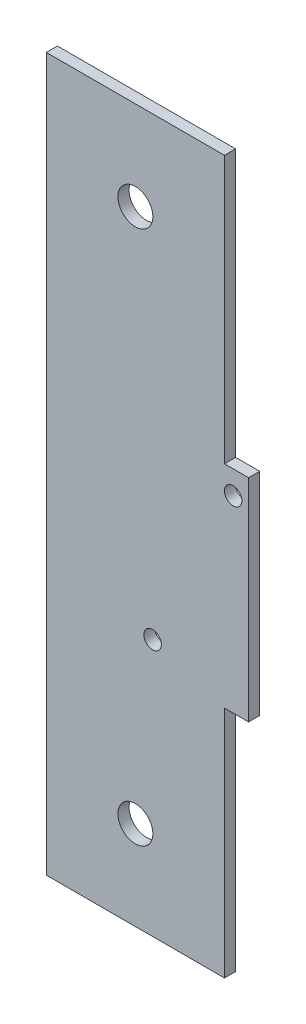
ISO-10303-21;
HEADER;
FILE_DESCRIPTION(('STEP AP214'),'2;1');
FILE_NAME('part.step','',(''),(''),'','','');
FILE_SCHEMA(('AUTOMOTIVE_DESIGN { 1 0 10303 214 1 1 1 1 }'));
ENDSEC;
DATA;
#1=APPLICATION_CONTEXT('core data for automotive mechanical design processes');
#2=APPLICATION_PROTOCOL_DEFINITION('international standard','automotive_design',2000,#1);
#3=PRODUCT_CONTEXT('',#1,'mechanical');
#4=PRODUCT('Part','Part','',(#3));
#5=PRODUCT_RELATED_PRODUCT_CATEGORY('part','',(#4));
#6=PRODUCT_DEFINITION_FORMATION('','',#4);
#7=PRODUCT_DEFINITION_CONTEXT('part definition',#1,'design');
#8=PRODUCT_DEFINITION('design','',#6,#7);
#9=PRODUCT_DEFINITION_SHAPE('','',#8);
#10=(LENGTH_UNIT() NAMED_UNIT(*) SI_UNIT(.MILLI.,.METRE.));
#11=(NAMED_UNIT(*) PLANE_ANGLE_UNIT() SI_UNIT($,.RADIAN.));
#12=(NAMED_UNIT(*) SI_UNIT($,.STERADIAN.) SOLID_ANGLE_UNIT());
#13=UNCERTAINTY_MEASURE_WITH_UNIT(LENGTH_MEASURE(1.E-05),#10,'distance_accuracy_value','');
#14=(GEOMETRIC_REPRESENTATION_CONTEXT(3) GLOBAL_UNCERTAINTY_ASSIGNED_CONTEXT((#13)) GLOBAL_UNIT_ASSIGNED_CONTEXT((#10,
#11,#12)) REPRESENTATION_CONTEXT('',''));
#15=CARTESIAN_POINT('',(0.,0.,0.));
#16=DIRECTION('',(0.,0.,1.));
#17=DIRECTION('',(1.,0.,0.));
#18=AXIS2_PLACEMENT_3D('',#15,#16,#17);
#19=CARTESIAN_POINT('',(0.,0.,1.5875));
#20=DIRECTION('',(0.,0.,1.));
#21=DIRECTION('',(1.,0.,0.));
#22=AXIS2_PLACEMENT_3D('',#19,#20,#21);
#23=PLANE('',#22);
#24=CARTESIAN_POINT('',(15.1551805399391,-115.738269015508,1.5875));
#25=DIRECTION('',(0.,0.,1.));
#26=DIRECTION('',(1.,0.,0.));
#27=AXIS2_PLACEMENT_3D('',#24,#25,#26);
#28=CIRCLE('',#27,1.24999999999989);
#29=CARTESIAN_POINT('',(16.405180539939,-115.738269015508,1.5875));
#30=VERTEX_POINT('',#29);
#31=EDGE_CURVE('E189',#30,#30,#28,.T.);
#32=ORIENTED_EDGE('',*,*,#31,.F.);
#33=EDGE_LOOP('',(#32));
#34=FACE_BOUND('',#33,.T.);
#35=CARTESIAN_POINT('',(12.7,-63.4999999999994,1.5875));
#36=DIRECTION('',(0.,0.,1.));
#37=DIRECTION('',(1.,0.,0.));
#38=AXIS2_PLACEMENT_3D('',#35,#36,#37);
#39=CIRCLE('',#38,2.4892);
#40=CARTESIAN_POINT('',(15.1892,-63.4999999999994,1.5875));
#41=VERTEX_POINT('',#40);
#42=EDGE_CURVE('E135',#41,#41,#39,.T.);
#43=ORIENTED_EDGE('',*,*,#42,.F.);
#44=EDGE_LOOP('',(#43));
#45=FACE_BOUND('',#44,.T.);
#46=DIRECTION('',(-1.,0.,0.));
#47=VECTOR('',#46,1.);
#48=CARTESIAN_POINT('',(25.3999999999991,-50.7999999999994,1.5875));
#49=LINE('',#48,#47);
#50=CARTESIAN_POINT('',(25.3999999999991,-50.7999999999994,1.5875));
#51=VERTEX_POINT('',#50);
#52=CARTESIAN_POINT('',(1.0187150381163E-12,-50.7999999999994,1.5875));
#53=VERTEX_POINT('',#52);
#54=EDGE_CURVE('E146',#51,#53,#49,.T.);
#55=ORIENTED_EDGE('',*,*,#54,.T.);
#56=DIRECTION('',(0.,-1.,0.));
#57=VECTOR('',#56,1.);
#58=CARTESIAN_POINT('',(1.0187150381163E-12,-50.7999999999994,1.5875));
#59=LINE('',#58,#57);
#60=CARTESIAN_POINT('',(1.0187150381163E-12,-152.399999999999,1.5875));
#61=VERTEX_POINT('',#60);
#62=EDGE_CURVE('E94',#53,#61,#59,.T.);
#63=ORIENTED_EDGE('',*,*,#62,.T.);
#64=DIRECTION('',(1.,0.,0.));
#65=VECTOR('',#64,1.);
#66=CARTESIAN_POINT('',(1.0187150381163E-12,-152.399999999999,1.5875));
#67=LINE('',#66,#65);
#68=CARTESIAN_POINT('',(25.3999999999991,-152.399999999999,1.5875));
#69=VERTEX_POINT('',#68);
#70=EDGE_CURVE('E161',#61,#69,#67,.T.);
#71=ORIENTED_EDGE('',*,*,#70,.T.);
#72=DIRECTION('',(0.,1.,0.));
#73=VECTOR('',#72,1.);
#74=CARTESIAN_POINT('',(25.3999999999991,-152.399999999999,1.5875));
#75=LINE('',#74,#73);
#76=CARTESIAN_POINT('',(25.3999999999991,-119.062499999999,1.5875));
#77=VERTEX_POINT('',#76);
#78=EDGE_CURVE('E174',#69,#77,#75,.T.);
#79=ORIENTED_EDGE('',*,*,#78,.T.);
#80=DIRECTION('',(1.,0.,0.));
#81=VECTOR('',#80,1.);
#82=CARTESIAN_POINT('',(25.3999999999991,-119.062499999999,1.5875));
#83=LINE('',#82,#81);
#84=CARTESIAN_POINT('',(28.8374754617669,-119.062499999999,1.5875));
#85=VERTEX_POINT('',#84);
#86=EDGE_CURVE('E113',#77,#85,#83,.T.);
#87=ORIENTED_EDGE('',*,*,#86,.T.);
#88=DIRECTION('',(0.,1.,0.));
#89=VECTOR('',#88,1.);
#90=CARTESIAN_POINT('',(28.8374754617669,-119.062499999999,1.5875));
#91=LINE('',#90,#89);
#92=CARTESIAN_POINT('',(28.8374754617669,-88.8999999999994,1.5875));
#93=VERTEX_POINT('',#92);
#94=EDGE_CURVE('E107',#85,#93,#91,.T.);
#95=ORIENTED_EDGE('',*,*,#94,.T.);
#96=DIRECTION('',(-1.,0.,0.));
#97=VECTOR('',#96,1.);
#98=CARTESIAN_POINT('',(28.8374754617669,-88.8999999999994,1.5875));
#99=LINE('',#98,#97);
#100=CARTESIAN_POINT('',(25.3999999999991,-88.8999999999994,1.5875));
#101=VERTEX_POINT('',#100);
#102=EDGE_CURVE('E111',#93,#101,#99,.T.);
#103=ORIENTED_EDGE('',*,*,#102,.T.);
#104=DIRECTION('',(0.,1.,0.));
#105=VECTOR('',#104,1.);
#106=CARTESIAN_POINT('',(25.3999999999991,-88.8999999999994,1.5875));
#107=LINE('',#106,#105);
#108=EDGE_CURVE('E51',#101,#51,#107,.T.);
#109=ORIENTED_EDGE('',*,*,#108,.T.);
#110=EDGE_LOOP('',(#55,#63,#71,#79,#87,#95,#103,#109));
#111=FACE_BOUND('',#110,.T.);
#112=CARTESIAN_POINT('',(12.7000000000001,-139.699999999999,1.5875));
#113=DIRECTION('',(0.,0.,1.));
#114=DIRECTION('',(1.,0.,0.));
#115=AXIS2_PLACEMENT_3D('',#112,#113,#114);
#116=CIRCLE('',#115,2.48920000000001);
#117=CARTESIAN_POINT('',(15.1892000000001,-139.699999999999,1.5875));
#118=VERTEX_POINT('',#117);
#119=EDGE_CURVE('E183',#118,#118,#116,.T.);
#120=ORIENTED_EDGE('',*,*,#119,.F.);
#121=EDGE_LOOP('',(#120));
#122=FACE_BOUND('',#121,.T.);
#123=CARTESIAN_POINT('',(26.6386436618155,-92.2301837100535,1.5875));
#124=DIRECTION('',(0.,0.,1.));
#125=DIRECTION('',(1.,0.,0.));
#126=AXIS2_PLACEMENT_3D('',#123,#124,#125);
#127=CIRCLE('',#126,1.24999999999989);
#128=CARTESIAN_POINT('',(27.8886436618154,-92.2301837100535,1.5875));
#129=VERTEX_POINT('',#128);
#130=EDGE_CURVE('E195',#129,#129,#127,.T.);
#131=ORIENTED_EDGE('',*,*,#130,.F.);
#132=EDGE_LOOP('',(#131));
#133=FACE_BOUND('',#132,.T.);
#134=ADVANCED_FACE('F34',(#34,#45,#111,#122,#133),#23,.T.);
#135=CARTESIAN_POINT('',(0.,0.,0.));
#136=DIRECTION('',(0.,0.,1.));
#137=DIRECTION('',(1.,0.,0.));
#138=AXIS2_PLACEMENT_3D('',#135,#136,#137);
#139=PLANE('',#138);
#140=DIRECTION('',(-1.,0.,0.));
#141=VECTOR('',#140,1.);
#142=CARTESIAN_POINT('',(25.3999999999991,-50.7999999999994,0.));
#143=LINE('',#142,#141);
#144=CARTESIAN_POINT('',(25.3999999999991,-50.7999999999994,0.));
#145=VERTEX_POINT('',#144);
#146=CARTESIAN_POINT('',(1.0187150381163E-12,-50.7999999999994,0.));
#147=VERTEX_POINT('',#146);
#148=EDGE_CURVE('E131',#145,#147,#143,.T.);
#149=ORIENTED_EDGE('',*,*,#148,.F.);
#150=DIRECTION('',(0.,1.,0.));
#151=VECTOR('',#150,1.);
#152=CARTESIAN_POINT('',(25.3999999999991,-88.8999999999994,0.));
#153=LINE('',#152,#151);
#154=CARTESIAN_POINT('',(25.3999999999991,-88.8999999999994,0.));
#155=VERTEX_POINT('',#154);
#156=EDGE_CURVE('E86',#155,#145,#153,.T.);
#157=ORIENTED_EDGE('',*,*,#156,.F.);
#158=DIRECTION('',(-1.,0.,0.));
#159=VECTOR('',#158,1.);
#160=CARTESIAN_POINT('',(28.8374754617669,-88.8999999999994,0.));
#161=LINE('',#160,#159);
#162=CARTESIAN_POINT('',(28.8374754617669,-88.8999999999994,0.));
#163=VERTEX_POINT('',#162);
#164=EDGE_CURVE('E80',#163,#155,#161,.T.);
#165=ORIENTED_EDGE('',*,*,#164,.F.);
#166=DIRECTION('',(0.,1.,0.));
#167=VECTOR('',#166,1.);
#168=CARTESIAN_POINT('',(28.8374754617669,-119.062499999999,0.));
#169=LINE('',#168,#167);
#170=CARTESIAN_POINT('',(28.8374754617669,-119.062499999999,0.));
#171=VERTEX_POINT('',#170);
#172=EDGE_CURVE('E121',#171,#163,#169,.T.);
#173=ORIENTED_EDGE('',*,*,#172,.F.);
#174=DIRECTION('',(1.,0.,0.));
#175=VECTOR('',#174,1.);
#176=CARTESIAN_POINT('',(25.3999999999991,-119.062499999999,0.));
#177=LINE('',#176,#175);
#178=CARTESIAN_POINT('',(25.3999999999991,-119.062499999999,0.));
#179=VERTEX_POINT('',#178);
#180=EDGE_CURVE('E141',#179,#171,#177,.T.);
#181=ORIENTED_EDGE('',*,*,#180,.F.);
#182=DIRECTION('',(0.,1.,0.));
#183=VECTOR('',#182,1.);
#184=CARTESIAN_POINT('',(25.3999999999991,-152.399999999999,0.));
#185=LINE('',#184,#183);
#186=CARTESIAN_POINT('',(25.3999999999991,-152.399999999999,0.));
#187=VERTEX_POINT('',#186);
#188=EDGE_CURVE('E139',#187,#179,#185,.T.);
#189=ORIENTED_EDGE('',*,*,#188,.F.);
#190=DIRECTION('',(1.,0.,0.));
#191=VECTOR('',#190,1.);
#192=CARTESIAN_POINT('',(1.0187150381163E-12,-152.399999999999,0.));
#193=LINE('',#192,#191);
#194=CARTESIAN_POINT('',(1.0187150381163E-12,-152.399999999999,0.));
#195=VERTEX_POINT('',#194);
#196=EDGE_CURVE('E137',#195,#187,#193,.T.);
#197=ORIENTED_EDGE('',*,*,#196,.F.);
#198=DIRECTION('',(0.,-1.,0.));
#199=VECTOR('',#198,1.);
#200=CARTESIAN_POINT('',(1.0187150381163E-12,-50.7999999999994,0.));
#201=LINE('',#200,#199);
#202=EDGE_CURVE('E134',#147,#195,#201,.T.);
#203=ORIENTED_EDGE('',*,*,#202,.F.);
#204=EDGE_LOOP('',(#149,#157,#165,#173,#181,#189,#197,#203));
#205=FACE_BOUND('',#204,.T.);
#206=CARTESIAN_POINT('',(12.7,-63.4999999999994,0.));
#207=DIRECTION('',(0.,0.,1.));
#208=DIRECTION('',(1.,0.,0.));
#209=AXIS2_PLACEMENT_3D('',#206,#207,#208);
#210=CIRCLE('',#209,2.4892);
#211=CARTESIAN_POINT('',(15.1892,-63.4999999999994,0.));
#212=VERTEX_POINT('',#211);
#213=EDGE_CURVE('E180',#212,#212,#210,.T.);
#214=ORIENTED_EDGE('',*,*,#213,.T.);
#215=EDGE_LOOP('',(#214));
#216=FACE_BOUND('',#215,.T.);
#217=CARTESIAN_POINT('',(12.7000000000001,-139.699999999999,0.));
#218=DIRECTION('',(0.,0.,1.));
#219=DIRECTION('',(1.,0.,0.));
#220=AXIS2_PLACEMENT_3D('',#217,#218,#219);
#221=CIRCLE('',#220,2.48920000000001);
#222=CARTESIAN_POINT('',(15.1892000000001,-139.699999999999,0.));
#223=VERTEX_POINT('',#222);
#224=EDGE_CURVE('E186',#223,#223,#221,.T.);
#225=ORIENTED_EDGE('',*,*,#224,.T.);
#226=EDGE_LOOP('',(#225));
#227=FACE_BOUND('',#226,.T.);
#228=CARTESIAN_POINT('',(15.1551805399391,-115.738269015508,0.));
#229=DIRECTION('',(0.,0.,1.));
#230=DIRECTION('',(1.,0.,0.));
#231=AXIS2_PLACEMENT_3D('',#228,#229,#230);
#232=CIRCLE('',#231,1.24999999999989);
#233=CARTESIAN_POINT('',(16.405180539939,-115.738269015508,0.));
#234=VERTEX_POINT('',#233);
#235=EDGE_CURVE('E192',#234,#234,#232,.T.);
#236=ORIENTED_EDGE('',*,*,#235,.T.);
#237=EDGE_LOOP('',(#236));
#238=FACE_BOUND('',#237,.T.);
#239=CARTESIAN_POINT('',(26.6386436618155,-92.2301837100535,0.));
#240=DIRECTION('',(0.,0.,1.));
#241=DIRECTION('',(1.,0.,0.));
#242=AXIS2_PLACEMENT_3D('',#239,#240,#241);
#243=CIRCLE('',#242,1.24999999999989);
#244=CARTESIAN_POINT('',(27.8886436618154,-92.2301837100535,0.));
#245=VERTEX_POINT('',#244);
#246=EDGE_CURVE('E198',#245,#245,#243,.T.);
#247=ORIENTED_EDGE('',*,*,#246,.T.);
#248=EDGE_LOOP('',(#247));
#249=FACE_BOUND('',#248,.T.);
#250=ADVANCED_FACE('F165',(#205,#216,#227,#238,#249),#139,.F.);
#251=CARTESIAN_POINT('',(25.3999999999991,-50.7999999999994,1.5875));
#252=DIRECTION('',(0.,-1.,0.));
#253=DIRECTION('',(0.,0.,-1.));
#254=AXIS2_PLACEMENT_3D('',#251,#252,#253);
#255=PLANE('',#254);
#256=ORIENTED_EDGE('',*,*,#148,.T.);
#257=DIRECTION('',(0.,0.,-1.));
#258=VECTOR('',#257,1.);
#259=CARTESIAN_POINT('',(1.0187150381163E-12,-50.7999999999994,1.5875));
#260=LINE('',#259,#258);
#261=EDGE_CURVE('E11',#53,#147,#260,.T.);
#262=ORIENTED_EDGE('',*,*,#261,.F.);
#263=ORIENTED_EDGE('',*,*,#54,.F.);
#264=DIRECTION('',(0.,0.,-1.));
#265=VECTOR('',#264,1.);
#266=CARTESIAN_POINT('',(25.3999999999991,-50.7999999999994,1.5875));
#267=LINE('',#266,#265);
#268=EDGE_CURVE('E127',#51,#145,#267,.T.);
#269=ORIENTED_EDGE('',*,*,#268,.T.);
#270=EDGE_LOOP('',(#256,#262,#263,#269));
#271=FACE_BOUND('',#270,.T.);
#272=ADVANCED_FACE('F36',(#271),#255,.F.);
#273=CARTESIAN_POINT('',(1.0187150381163E-12,-50.7999999999994,1.5875));
#274=DIRECTION('',(1.,0.,0.));
#275=DIRECTION('',(0.,0.,-1.));
#276=AXIS2_PLACEMENT_3D('',#273,#274,#275);
#277=PLANE('',#276);
#278=ORIENTED_EDGE('',*,*,#202,.T.);
#279=DIRECTION('',(0.,0.,-1.));
#280=VECTOR('',#279,1.);
#281=CARTESIAN_POINT('',(1.0187150381163E-12,-152.399999999999,1.5875));
#282=LINE('',#281,#280);
#283=EDGE_CURVE('E43',#61,#195,#282,.T.);
#284=ORIENTED_EDGE('',*,*,#283,.F.);
#285=ORIENTED_EDGE('',*,*,#62,.F.);
#286=ORIENTED_EDGE('',*,*,#261,.T.);
#287=EDGE_LOOP('',(#278,#284,#285,#286));
#288=FACE_BOUND('',#287,.T.);
#289=ADVANCED_FACE('F232',(#288),#277,.F.);
#290=CARTESIAN_POINT('',(1.0187150381163E-12,-152.399999999999,1.5875));
#291=DIRECTION('',(0.,1.,0.));
#292=DIRECTION('',(0.,0.,1.));
#293=AXIS2_PLACEMENT_3D('',#290,#291,#292);
#294=PLANE('',#293);
#295=ORIENTED_EDGE('',*,*,#196,.T.);
#296=DIRECTION('',(0.,0.,-1.));
#297=VECTOR('',#296,1.);
#298=CARTESIAN_POINT('',(25.3999999999991,-152.399999999999,1.5875));
#299=LINE('',#298,#297);
#300=EDGE_CURVE('E153',#69,#187,#299,.T.);
#301=ORIENTED_EDGE('',*,*,#300,.F.);
#302=ORIENTED_EDGE('',*,*,#70,.F.);
#303=ORIENTED_EDGE('',*,*,#283,.T.);
#304=EDGE_LOOP('',(#295,#301,#302,#303));
#305=FACE_BOUND('',#304,.T.);
#306=ADVANCED_FACE('F159',(#305),#294,.F.);
#307=CARTESIAN_POINT('',(25.3999999999991,-152.399999999999,1.5875));
#308=DIRECTION('',(-1.,0.,0.));
#309=DIRECTION('',(0.,0.,1.));
#310=AXIS2_PLACEMENT_3D('',#307,#308,#309);
#311=PLANE('',#310);
#312=ORIENTED_EDGE('',*,*,#188,.T.);
#313=DIRECTION('',(0.,0.,-1.));
#314=VECTOR('',#313,1.);
#315=CARTESIAN_POINT('',(25.3999999999991,-119.062499999999,1.5875));
#316=LINE('',#315,#314);
#317=EDGE_CURVE('E150',#77,#179,#316,.T.);
#318=ORIENTED_EDGE('',*,*,#317,.F.);
#319=ORIENTED_EDGE('',*,*,#78,.F.);
#320=ORIENTED_EDGE('',*,*,#300,.T.);
#321=EDGE_LOOP('',(#312,#318,#319,#320));
#322=FACE_BOUND('',#321,.T.);
#323=ADVANCED_FACE('F170',(#322),#311,.F.);
#324=CARTESIAN_POINT('',(25.3999999999991,-119.062499999999,1.5875));
#325=DIRECTION('',(0.,1.,0.));
#326=DIRECTION('',(0.,0.,1.));
#327=AXIS2_PLACEMENT_3D('',#324,#325,#326);
#328=PLANE('',#327);
#329=ORIENTED_EDGE('',*,*,#180,.T.);
#330=DIRECTION('',(0.,0.,-1.));
#331=VECTOR('',#330,1.);
#332=CARTESIAN_POINT('',(28.8374754617669,-119.062499999999,1.5875));
#333=LINE('',#332,#331);
#334=EDGE_CURVE('E122',#85,#171,#333,.T.);
#335=ORIENTED_EDGE('',*,*,#334,.F.);
#336=ORIENTED_EDGE('',*,*,#86,.F.);
#337=ORIENTED_EDGE('',*,*,#317,.T.);
#338=EDGE_LOOP('',(#329,#335,#336,#337));
#339=FACE_BOUND('',#338,.T.);
#340=ADVANCED_FACE('F173',(#339),#328,.F.);
#341=CARTESIAN_POINT('',(28.8374754617669,-119.062499999999,1.5875));
#342=DIRECTION('',(-1.,0.,0.));
#343=DIRECTION('',(0.,0.,1.));
#344=AXIS2_PLACEMENT_3D('',#341,#342,#343);
#345=PLANE('',#344);
#346=ORIENTED_EDGE('',*,*,#172,.T.);
#347=DIRECTION('',(0.,0.,-1.));
#348=VECTOR('',#347,1.);
#349=CARTESIAN_POINT('',(28.8374754617669,-88.8999999999994,1.5875));
#350=LINE('',#349,#348);
#351=EDGE_CURVE('E118',#93,#163,#350,.T.);
#352=ORIENTED_EDGE('',*,*,#351,.F.);
#353=ORIENTED_EDGE('',*,*,#94,.F.);
#354=ORIENTED_EDGE('',*,*,#334,.T.);
#355=EDGE_LOOP('',(#346,#352,#353,#354));
#356=FACE_BOUND('',#355,.T.);
#357=ADVANCED_FACE('F119',(#356),#345,.F.);
#358=CARTESIAN_POINT('',(28.8374754617669,-88.8999999999994,1.5875));
#359=DIRECTION('',(0.,-1.,0.));
#360=DIRECTION('',(0.,0.,-1.));
#361=AXIS2_PLACEMENT_3D('',#358,#359,#360);
#362=PLANE('',#361);
#363=ORIENTED_EDGE('',*,*,#164,.T.);
#364=DIRECTION('',(0.,0.,-1.));
#365=VECTOR('',#364,1.);
#366=CARTESIAN_POINT('',(25.3999999999991,-88.8999999999994,1.5875));
#367=LINE('',#366,#365);
#368=EDGE_CURVE('E123',#101,#155,#367,.T.);
#369=ORIENTED_EDGE('',*,*,#368,.F.);
#370=ORIENTED_EDGE('',*,*,#102,.F.);
#371=ORIENTED_EDGE('',*,*,#351,.T.);
#372=EDGE_LOOP('',(#363,#369,#370,#371));
#373=FACE_BOUND('',#372,.T.);
#374=ADVANCED_FACE('F125',(#373),#362,.F.);
#375=CARTESIAN_POINT('',(25.3999999999991,-88.8999999999994,1.5875));
#376=DIRECTION('',(-1.,0.,0.));
#377=DIRECTION('',(0.,0.,1.));
#378=AXIS2_PLACEMENT_3D('',#375,#376,#377);
#379=PLANE('',#378);
#380=ORIENTED_EDGE('',*,*,#156,.T.);
#381=ORIENTED_EDGE('',*,*,#268,.F.);
#382=ORIENTED_EDGE('',*,*,#108,.F.);
#383=ORIENTED_EDGE('',*,*,#368,.T.);
#384=EDGE_LOOP('',(#380,#381,#382,#383));
#385=FACE_BOUND('',#384,.T.);
#386=ADVANCED_FACE('F220',(#385),#379,.F.);
#387=CARTESIAN_POINT('',(12.7,-63.4999999999994,1.5875));
#388=DIRECTION('',(0.,0.,-1.));
#389=DIRECTION('',(-1.,0.,0.));
#390=AXIS2_PLACEMENT_3D('',#387,#388,#389);
#391=CYLINDRICAL_SURFACE('',#390,2.4892);
#392=ORIENTED_EDGE('',*,*,#42,.T.);
#393=EDGE_LOOP('',(#392));
#394=FACE_BOUND('',#393,.T.);
#395=ORIENTED_EDGE('',*,*,#213,.F.);
#396=EDGE_LOOP('',(#395));
#397=FACE_BOUND('',#396,.T.);
#398=ADVANCED_FACE('F217',(#394,#397),#391,.F.);
#399=CARTESIAN_POINT('',(12.7000000000001,-139.699999999999,1.5875));
#400=DIRECTION('',(0.,0.,-1.));
#401=DIRECTION('',(-1.,0.,0.));
#402=AXIS2_PLACEMENT_3D('',#399,#400,#401);
#403=CYLINDRICAL_SURFACE('',#402,2.48920000000001);
#404=ORIENTED_EDGE('',*,*,#119,.T.);
#405=EDGE_LOOP('',(#404));
#406=FACE_BOUND('',#405,.T.);
#407=ORIENTED_EDGE('',*,*,#224,.F.);
#408=EDGE_LOOP('',(#407));
#409=FACE_BOUND('',#408,.T.);
#410=ADVANCED_FACE('F296',(#406,#409),#403,.F.);
#411=CARTESIAN_POINT('',(15.1551805399391,-115.738269015508,1.5875));
#412=DIRECTION('',(0.,0.,-1.));
#413=DIRECTION('',(-1.,0.,0.));
#414=AXIS2_PLACEMENT_3D('',#411,#412,#413);
#415=CYLINDRICAL_SURFACE('',#414,1.24999999999989);
#416=ORIENTED_EDGE('',*,*,#31,.T.);
#417=EDGE_LOOP('',(#416));
#418=FACE_BOUND('',#417,.T.);
#419=ORIENTED_EDGE('',*,*,#235,.F.);
#420=EDGE_LOOP('',(#419));
#421=FACE_BOUND('',#420,.T.);
#422=ADVANCED_FACE('F304',(#418,#421),#415,.F.);
#423=CARTESIAN_POINT('',(26.6386436618155,-92.2301837100535,1.5875));
#424=DIRECTION('',(0.,0.,-1.));
#425=DIRECTION('',(-1.,0.,0.));
#426=AXIS2_PLACEMENT_3D('',#423,#424,#425);
#427=CYLINDRICAL_SURFACE('',#426,1.24999999999989);
#428=ORIENTED_EDGE('',*,*,#130,.T.);
#429=EDGE_LOOP('',(#428));
#430=FACE_BOUND('',#429,.T.);
#431=ORIENTED_EDGE('',*,*,#246,.F.);
#432=EDGE_LOOP('',(#431));
#433=FACE_BOUND('',#432,.T.);
#434=ADVANCED_FACE('F204',(#430,#433),#427,.F.);
#435=CLOSED_SHELL('',(#134,#250,#272,#289,#306,#323,#340,#357,#374,#386,#398,#410,#422,#434));
#436=MANIFOLD_SOLID_BREP('B2',#435);
#437=ADVANCED_BREP_SHAPE_REPRESENTATION('',(#18,#436),#14);
#438=SHAPE_DEFINITION_REPRESENTATION(#9,#437);
ENDSEC;
END-ISO-10303-21;
